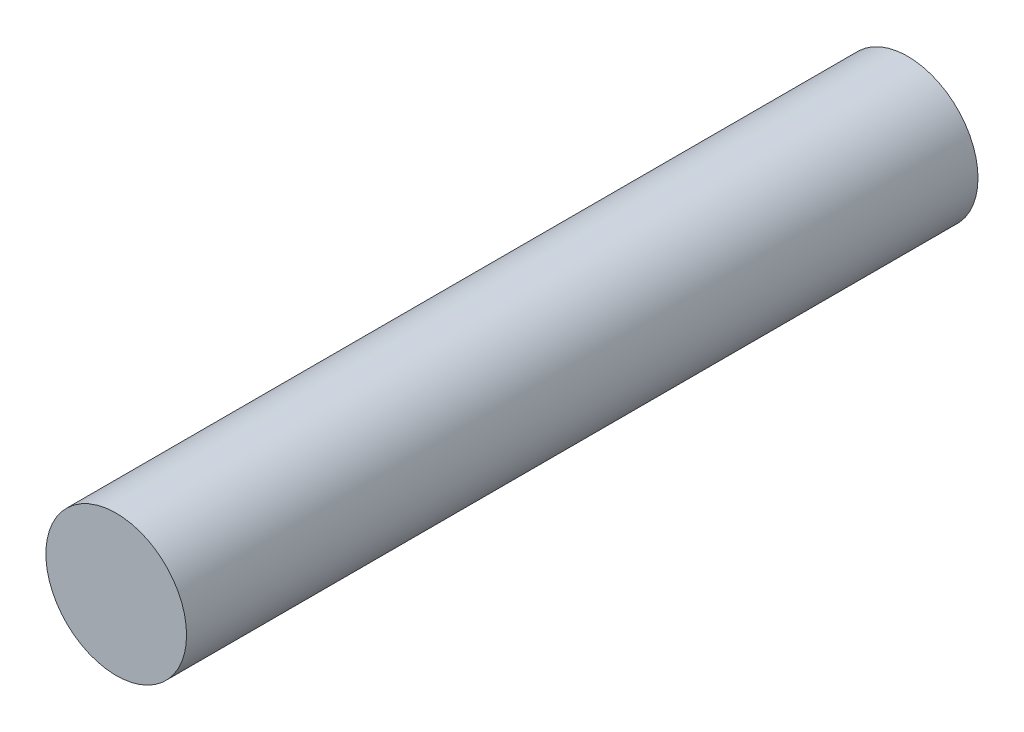
ISO-10303-21;
HEADER;
FILE_DESCRIPTION(('STEP AP214'),'2;1');
FILE_NAME('part.step','',(''),(''),'','','');
FILE_SCHEMA(('AUTOMOTIVE_DESIGN { 1 0 10303 214 1 1 1 1 }'));
ENDSEC;
DATA;
#1=APPLICATION_CONTEXT('core data for automotive mechanical design processes');
#2=APPLICATION_PROTOCOL_DEFINITION('international standard','automotive_design',2000,#1);
#3=PRODUCT_CONTEXT('',#1,'mechanical');
#4=PRODUCT('Part','Part','',(#3));
#5=PRODUCT_RELATED_PRODUCT_CATEGORY('part','',(#4));
#6=PRODUCT_DEFINITION_FORMATION('','',#4);
#7=PRODUCT_DEFINITION_CONTEXT('part definition',#1,'design');
#8=PRODUCT_DEFINITION('design','',#6,#7);
#9=PRODUCT_DEFINITION_SHAPE('','',#8);
#10=(LENGTH_UNIT() NAMED_UNIT(*) SI_UNIT(.MILLI.,.METRE.));
#11=(NAMED_UNIT(*) PLANE_ANGLE_UNIT() SI_UNIT($,.RADIAN.));
#12=(NAMED_UNIT(*) SI_UNIT($,.STERADIAN.) SOLID_ANGLE_UNIT());
#13=UNCERTAINTY_MEASURE_WITH_UNIT(LENGTH_MEASURE(1.E-05),#10,'distance_accuracy_value','');
#14=(GEOMETRIC_REPRESENTATION_CONTEXT(3) GLOBAL_UNCERTAINTY_ASSIGNED_CONTEXT((#13)) GLOBAL_UNIT_ASSIGNED_CONTEXT((#10,
#11,#12)) REPRESENTATION_CONTEXT('',''));
#15=CARTESIAN_POINT('',(0.,0.,0.));
#16=DIRECTION('',(0.,0.,1.));
#17=DIRECTION('',(1.,0.,0.));
#18=AXIS2_PLACEMENT_3D('',#15,#16,#17);
#19=CARTESIAN_POINT('',(0.,0.,0.));
#20=DIRECTION('',(0.,0.,1.));
#21=DIRECTION('',(1.,0.,0.));
#22=AXIS2_PLACEMENT_3D('',#19,#20,#21);
#23=PLANE('',#22);
#24=CARTESIAN_POINT('',(0.,0.,0.));
#25=DIRECTION('',(0.,0.,1.));
#26=DIRECTION('',(1.,0.,0.));
#27=AXIS2_PLACEMENT_3D('',#24,#25,#26);
#28=CIRCLE('',#27,4.);
#29=CARTESIAN_POINT('',(4.,0.,0.));
#30=VERTEX_POINT('',#29);
#31=EDGE_CURVE('E10',#30,#30,#28,.T.);
#32=ORIENTED_EDGE('',*,*,#31,.F.);
#33=EDGE_LOOP('',(#32));
#34=FACE_BOUND('',#33,.T.);
#35=CARTESIAN_POINT('',(0.,0.,0.));
#36=DIRECTION('',(0.,0.,1.));
#37=DIRECTION('',(1.,0.,0.));
#38=AXIS2_PLACEMENT_3D('',#35,#36,#37);
#39=CIRCLE('',#38,2.5);
#40=CARTESIAN_POINT('',(2.5,0.,0.));
#41=VERTEX_POINT('',#40);
#42=EDGE_CURVE('E49',#41,#41,#39,.T.);
#43=ORIENTED_EDGE('',*,*,#42,.T.);
#44=EDGE_LOOP('',(#43));
#45=FACE_BOUND('',#44,.T.);
#46=ADVANCED_FACE('F41',(#34,#45),#23,.F.);
#47=CARTESIAN_POINT('',(0.,0.,5.));
#48=DIRECTION('',(0.,0.,-1.));
#49=DIRECTION('',(-1.,0.,0.));
#50=AXIS2_PLACEMENT_3D('',#47,#48,#49);
#51=CYLINDRICAL_SURFACE('',#50,4.);
#52=ORIENTED_EDGE('',*,*,#31,.T.);
#53=EDGE_LOOP('',(#52));
#54=FACE_BOUND('',#53,.T.);
#55=CARTESIAN_POINT('',(0.,0.,45.));
#56=DIRECTION('',(0.,0.,1.));
#57=DIRECTION('',(1.,0.,0.));
#58=AXIS2_PLACEMENT_3D('',#55,#56,#57);
#59=CIRCLE('',#58,4.);
#60=CARTESIAN_POINT('',(4.,0.,45.));
#61=VERTEX_POINT('',#60);
#62=EDGE_CURVE('E59',#61,#61,#59,.T.);
#63=ORIENTED_EDGE('',*,*,#62,.F.);
#64=EDGE_LOOP('',(#63));
#65=FACE_BOUND('',#64,.T.);
#66=ADVANCED_FACE('F43',(#54,#65),#51,.T.);
#67=CARTESIAN_POINT('',(0.,0.,5.));
#68=DIRECTION('',(0.,0.,-1.));
#69=DIRECTION('',(-1.,0.,0.));
#70=AXIS2_PLACEMENT_3D('',#67,#68,#69);
#71=CYLINDRICAL_SURFACE('',#70,2.5);
#72=CARTESIAN_POINT('',(0.,0.,5.));
#73=DIRECTION('',(0.,0.,1.));
#74=DIRECTION('',(1.,0.,0.));
#75=AXIS2_PLACEMENT_3D('',#72,#73,#74);
#76=CIRCLE('',#75,2.5);
#77=CARTESIAN_POINT('',(2.5,0.,5.));
#78=VERTEX_POINT('',#77);
#79=EDGE_CURVE('E54',#78,#78,#76,.T.);
#80=ORIENTED_EDGE('',*,*,#79,.T.);
#81=EDGE_LOOP('',(#80));
#82=FACE_BOUND('',#81,.T.);
#83=ORIENTED_EDGE('',*,*,#42,.F.);
#84=EDGE_LOOP('',(#83));
#85=FACE_BOUND('',#84,.T.);
#86=ADVANCED_FACE('F69',(#82,#85),#71,.F.);
#87=CARTESIAN_POINT('',(0.,0.,5.));
#88=DIRECTION('',(0.,0.,1.));
#89=DIRECTION('',(1.,0.,0.));
#90=AXIS2_PLACEMENT_3D('',#87,#88,#89);
#91=PLANE('',#90);
#92=ORIENTED_EDGE('',*,*,#79,.F.);
#93=EDGE_LOOP('',(#92));
#94=FACE_BOUND('',#93,.T.);
#95=ADVANCED_FACE('F74',(#94),#91,.F.);
#96=CARTESIAN_POINT('',(0.,0.,45.));
#97=DIRECTION('',(0.,0.,1.));
#98=DIRECTION('',(1.,0.,0.));
#99=AXIS2_PLACEMENT_3D('',#96,#97,#98);
#100=PLANE('',#99);
#101=ORIENTED_EDGE('',*,*,#62,.T.);
#102=EDGE_LOOP('',(#101));
#103=FACE_BOUND('',#102,.T.);
#104=ADVANCED_FACE('F66',(#103),#100,.T.);
#105=CLOSED_SHELL('',(#46,#66,#86,#95,#104));
#106=MANIFOLD_SOLID_BREP('B2',#105);
#107=ADVANCED_BREP_SHAPE_REPRESENTATION('',(#18,#106),#14);
#108=SHAPE_DEFINITION_REPRESENTATION(#9,#107);
ENDSEC;
END-ISO-10303-21;
